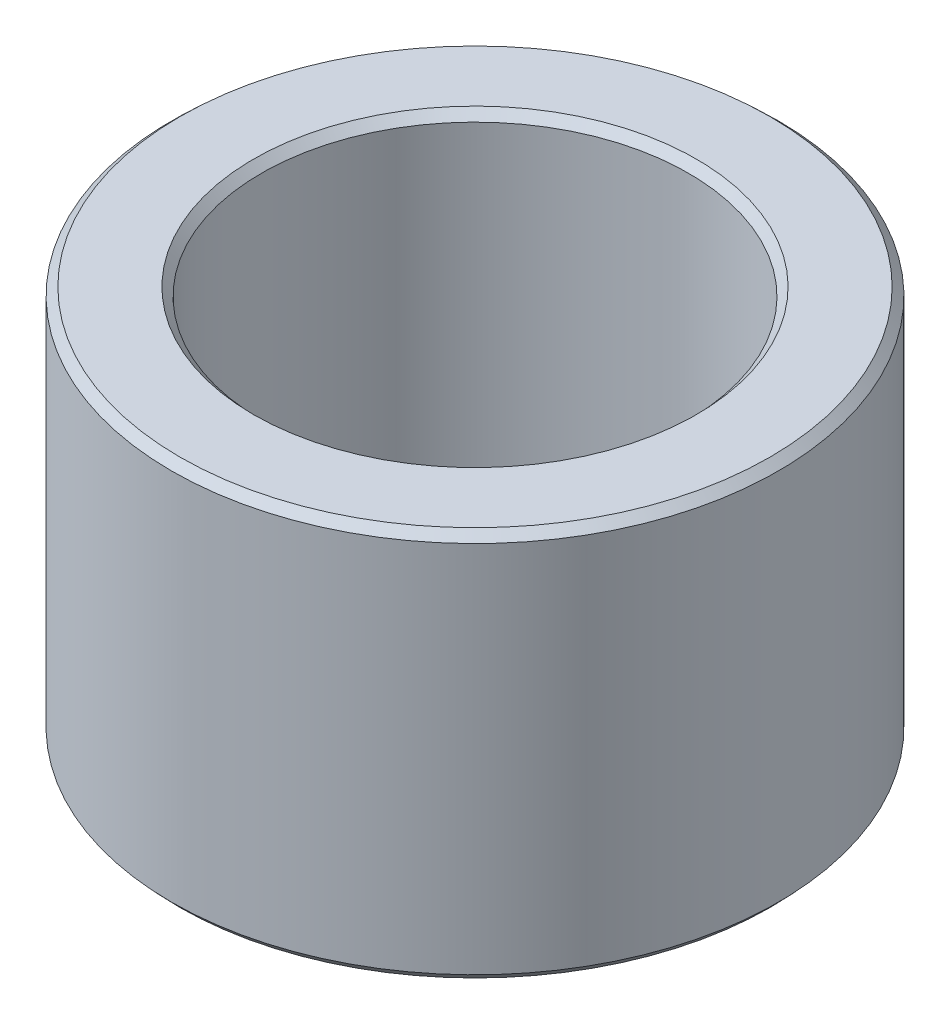
ISO-10303-21;
HEADER;
FILE_DESCRIPTION(('STEP AP214'),'2;1');
FILE_NAME('part.step','',(''),(''),'','','');
FILE_SCHEMA(('AUTOMOTIVE_DESIGN { 1 0 10303 214 1 1 1 1 }'));
ENDSEC;
DATA;
#1=APPLICATION_CONTEXT('core data for automotive mechanical design processes');
#2=APPLICATION_PROTOCOL_DEFINITION('international standard','automotive_design',2000,#1);
#3=PRODUCT_CONTEXT('',#1,'mechanical');
#4=PRODUCT('Part','Part','',(#3));
#5=PRODUCT_RELATED_PRODUCT_CATEGORY('part','',(#4));
#6=PRODUCT_DEFINITION_FORMATION('','',#4);
#7=PRODUCT_DEFINITION_CONTEXT('part definition',#1,'design');
#8=PRODUCT_DEFINITION('design','',#6,#7);
#9=PRODUCT_DEFINITION_SHAPE('','',#8);
#10=(LENGTH_UNIT() NAMED_UNIT(*) SI_UNIT(.MILLI.,.METRE.));
#11=(NAMED_UNIT(*) PLANE_ANGLE_UNIT() SI_UNIT($,.RADIAN.));
#12=(NAMED_UNIT(*) SI_UNIT($,.STERADIAN.) SOLID_ANGLE_UNIT());
#13=UNCERTAINTY_MEASURE_WITH_UNIT(LENGTH_MEASURE(1.E-05),#10,'distance_accuracy_value','');
#14=(GEOMETRIC_REPRESENTATION_CONTEXT(3) GLOBAL_UNCERTAINTY_ASSIGNED_CONTEXT((#13)) GLOBAL_UNIT_ASSIGNED_CONTEXT((#10,
#11,#12)) REPRESENTATION_CONTEXT('',''));
#15=CARTESIAN_POINT('',(0.,0.,0.));
#16=DIRECTION('',(0.,0.,1.));
#17=DIRECTION('',(1.,0.,0.));
#18=AXIS2_PLACEMENT_3D('',#15,#16,#17);
#19=CARTESIAN_POINT('',(0.,16.0575787596858,0.));
#20=DIRECTION('',(0.,-1.,0.));
#21=DIRECTION('',(0.,0.,-1.));
#22=AXIS2_PLACEMENT_3D('',#19,#20,#21);
#23=CYLINDRICAL_SURFACE('',#22,12.5);
#24=CARTESIAN_POINT('',(0.,0.343251061589028,0.));
#25=DIRECTION('',(0.,1.,0.));
#26=DIRECTION('',(0.,0.,1.));
#27=AXIS2_PLACEMENT_3D('',#24,#25,#26);
#28=CIRCLE('',#27,12.5);
#29=CARTESIAN_POINT('',(0.,0.343251061589028,12.5));
#30=VERTEX_POINT('',#29);
#31=EDGE_CURVE('E10',#30,#30,#28,.T.);
#32=ORIENTED_EDGE('',*,*,#31,.T.);
#33=EDGE_LOOP('',(#32));
#34=FACE_BOUND('',#33,.T.);
#35=CARTESIAN_POINT('',(0.,15.7338567106254,0.));
#36=DIRECTION('',(0.,1.,0.));
#37=DIRECTION('',(0.,0.,1.));
#38=AXIS2_PLACEMENT_3D('',#35,#36,#37);
#39=CIRCLE('',#38,12.5);
#40=CARTESIAN_POINT('',(0.,15.7338567106254,12.5));
#41=VERTEX_POINT('',#40);
#42=EDGE_CURVE('E50',#41,#41,#39,.F.);
#43=ORIENTED_EDGE('',*,*,#42,.T.);
#44=EDGE_LOOP('',(#43));
#45=FACE_BOUND('',#44,.T.);
#46=ADVANCED_FACE('F39',(#34,#45),#23,.T.);
#47=CARTESIAN_POINT('',(0.,16.0575787596858,0.));
#48=DIRECTION('',(0.,1.,0.));
#49=DIRECTION('',(0.,0.,1.));
#50=AXIS2_PLACEMENT_3D('',#47,#48,#49);
#51=PLANE('',#50);
#52=CARTESIAN_POINT('',(0.,16.0575787596858,0.));
#53=DIRECTION('',(0.,1.,0.));
#54=DIRECTION('',(0.,0.,1.));
#55=AXIS2_PLACEMENT_3D('',#52,#53,#54);
#56=CIRCLE('',#55,9.12409744310554);
#57=CARTESIAN_POINT('',(0.,16.0575787596858,9.12409744310554));
#58=VERTEX_POINT('',#57);
#59=EDGE_CURVE('E58',#58,#58,#56,.F.);
#60=ORIENTED_EDGE('',*,*,#59,.T.);
#61=EDGE_LOOP('',(#60));
#62=FACE_BOUND('',#61,.T.);
#63=CARTESIAN_POINT('',(0.,16.0575787596858,0.));
#64=DIRECTION('',(0.,1.,0.));
#65=DIRECTION('',(0.,0.,1.));
#66=AXIS2_PLACEMENT_3D('',#63,#64,#65);
#67=CIRCLE('',#66,12.156748938411);
#68=CARTESIAN_POINT('',(0.,16.0575787596858,12.156748938411));
#69=VERTEX_POINT('',#68);
#70=EDGE_CURVE('E61',#69,#69,#67,.T.);
#71=ORIENTED_EDGE('',*,*,#70,.T.);
#72=EDGE_LOOP('',(#71));
#73=FACE_BOUND('',#72,.T.);
#74=ADVANCED_FACE('F88',(#62,#73),#51,.T.);
#75=CARTESIAN_POINT('',(0.,0.,0.));
#76=DIRECTION('',(0.,1.,0.));
#77=DIRECTION('',(0.,0.,1.));
#78=AXIS2_PLACEMENT_3D('',#75,#76,#77);
#79=PLANE('',#78);
#80=CARTESIAN_POINT('',(0.,0.,0.));
#81=DIRECTION('',(0.,1.,0.));
#82=DIRECTION('',(0.,0.,1.));
#83=AXIS2_PLACEMENT_3D('',#80,#81,#82);
#84=CIRCLE('',#83,9.14362645563413);
#85=CARTESIAN_POINT('',(0.,0.,9.14362645563413));
#86=VERTEX_POINT('',#85);
#87=EDGE_CURVE('E51',#86,#86,#84,.T.);
#88=ORIENTED_EDGE('',*,*,#87,.T.);
#89=EDGE_LOOP('',(#88));
#90=FACE_BOUND('',#89,.T.);
#91=CARTESIAN_POINT('',(0.,0.,0.));
#92=DIRECTION('',(0.,1.,0.));
#93=DIRECTION('',(0.,0.,1.));
#94=AXIS2_PLACEMENT_3D('',#91,#92,#93);
#95=CIRCLE('',#94,12.1762779509396);
#96=CARTESIAN_POINT('',(0.,0.,12.1762779509396));
#97=VERTEX_POINT('',#96);
#98=EDGE_CURVE('E54',#97,#97,#95,.F.);
#99=ORIENTED_EDGE('',*,*,#98,.T.);
#100=EDGE_LOOP('',(#99));
#101=FACE_BOUND('',#100,.T.);
#102=ADVANCED_FACE('F83',(#90,#101),#79,.F.);
#103=CARTESIAN_POINT('',(0.,16.0575787596858,0.));
#104=DIRECTION('',(0.,-1.,0.));
#105=DIRECTION('',(0.,0.,-1.));
#106=AXIS2_PLACEMENT_3D('',#103,#104,#105);
#107=CYLINDRICAL_SURFACE('',#106,8.80037539404511);
#108=CARTESIAN_POINT('',(0.,15.7143276980968,0.));
#109=DIRECTION('',(0.,1.,0.));
#110=DIRECTION('',(0.,0.,1.));
#111=AXIS2_PLACEMENT_3D('',#108,#109,#110);
#112=CIRCLE('',#111,8.80037539404511);
#113=CARTESIAN_POINT('',(0.,15.7143276980968,8.80037539404511));
#114=VERTEX_POINT('',#113);
#115=EDGE_CURVE('E67',#114,#114,#112,.T.);
#116=ORIENTED_EDGE('',*,*,#115,.T.);
#117=EDGE_LOOP('',(#116));
#118=FACE_BOUND('',#117,.T.);
#119=CARTESIAN_POINT('',(0.,0.323722049060442,0.));
#120=DIRECTION('',(0.,1.,0.));
#121=DIRECTION('',(0.,0.,1.));
#122=AXIS2_PLACEMENT_3D('',#119,#120,#121);
#123=CIRCLE('',#122,8.80037539404511);
#124=CARTESIAN_POINT('',(0.,0.323722049060442,8.80037539404511));
#125=VERTEX_POINT('',#124);
#126=EDGE_CURVE('E69',#125,#125,#123,.F.);
#127=ORIENTED_EDGE('',*,*,#126,.T.);
#128=EDGE_LOOP('',(#127));
#129=FACE_BOUND('',#128,.T.);
#130=ADVANCED_FACE('F71',(#118,#129),#107,.F.);
#131=CARTESIAN_POINT('',(0.,15.7143276980968,0.));
#132=DIRECTION('',(0.,1.,0.));
#133=DIRECTION('',(0.,0.,1.));
#134=AXIS2_PLACEMENT_3D('',#131,#132,#133);
#135=CONICAL_SURFACE('',#134,8.80037539404511,0.756126466829008);
#136=ORIENTED_EDGE('',*,*,#59,.F.);
#137=EDGE_LOOP('',(#136));
#138=FACE_BOUND('',#137,.T.);
#139=ORIENTED_EDGE('',*,*,#115,.F.);
#140=EDGE_LOOP('',(#139));
#141=FACE_BOUND('',#140,.T.);
#142=ADVANCED_FACE('F77',(#138,#141),#135,.F.);
#143=CARTESIAN_POINT('',(0.,0.,0.));
#144=DIRECTION('',(0.,-1.,0.));
#145=DIRECTION('',(0.,0.,-1.));
#146=AXIS2_PLACEMENT_3D('',#143,#144,#145);
#147=CONICAL_SURFACE('',#146,9.14362645563413,0.814669859965872);
#148=ORIENTED_EDGE('',*,*,#126,.F.);
#149=EDGE_LOOP('',(#148));
#150=FACE_BOUND('',#149,.T.);
#151=ORIENTED_EDGE('',*,*,#87,.F.);
#152=EDGE_LOOP('',(#151));
#153=FACE_BOUND('',#152,.T.);
#154=ADVANCED_FACE('F73',(#150,#153),#147,.F.);
#155=CARTESIAN_POINT('',(0.,0.343251061589028,0.));
#156=DIRECTION('',(0.,1.,0.));
#157=DIRECTION('',(0.,0.,1.));
#158=AXIS2_PLACEMENT_3D('',#155,#156,#157);
#159=CONICAL_SURFACE('',#158,12.5,0.756126466829022);
#160=ORIENTED_EDGE('',*,*,#98,.F.);
#161=EDGE_LOOP('',(#160));
#162=FACE_BOUND('',#161,.T.);
#163=ORIENTED_EDGE('',*,*,#31,.F.);
#164=EDGE_LOOP('',(#163));
#165=FACE_BOUND('',#164,.T.);
#166=ADVANCED_FACE('F76',(#162,#165),#159,.T.);
#167=CARTESIAN_POINT('',(0.,16.0575787596858,0.));
#168=DIRECTION('',(0.,-1.,0.));
#169=DIRECTION('',(0.,0.,-1.));
#170=AXIS2_PLACEMENT_3D('',#167,#168,#169);
#171=CONICAL_SURFACE('',#170,12.156748938411,0.814669859965864);
#172=ORIENTED_EDGE('',*,*,#42,.F.);
#173=EDGE_LOOP('',(#172));
#174=FACE_BOUND('',#173,.T.);
#175=ORIENTED_EDGE('',*,*,#70,.F.);
#176=EDGE_LOOP('',(#175));
#177=FACE_BOUND('',#176,.T.);
#178=ADVANCED_FACE('F45',(#174,#177),#171,.T.);
#179=CLOSED_SHELL('',(#46,#74,#102,#130,#142,#154,#166,#178));
#180=MANIFOLD_SOLID_BREP('B2',#179);
#181=ADVANCED_BREP_SHAPE_REPRESENTATION('',(#18,#180),#14);
#182=SHAPE_DEFINITION_REPRESENTATION(#9,#181);
ENDSEC;
END-ISO-10303-21;
